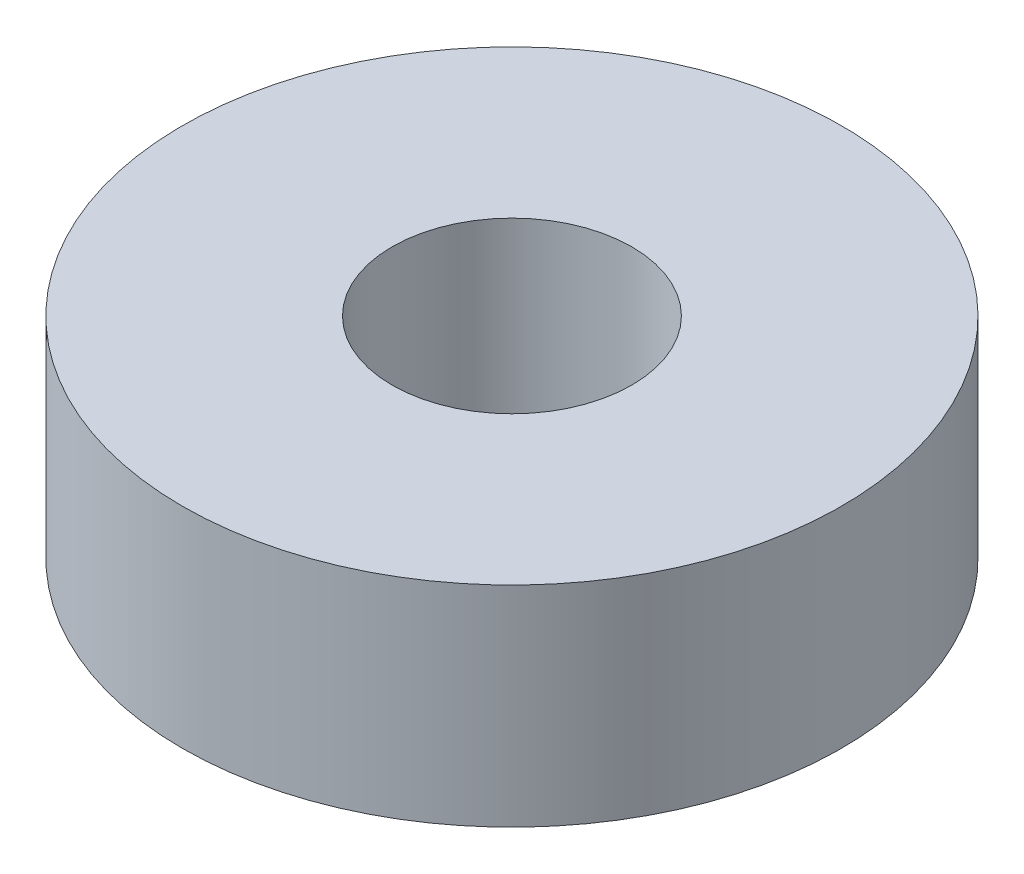
ISO-10303-21;
HEADER;
FILE_DESCRIPTION(('STEP AP214'),'2;1');
FILE_NAME('part.step','',(''),(''),'','','');
FILE_SCHEMA(('AUTOMOTIVE_DESIGN { 1 0 10303 214 1 1 1 1 }'));
ENDSEC;
DATA;
#1=APPLICATION_CONTEXT('core data for automotive mechanical design processes');
#2=APPLICATION_PROTOCOL_DEFINITION('international standard','automotive_design',2000,#1);
#3=PRODUCT_CONTEXT('',#1,'mechanical');
#4=PRODUCT('Part','Part','',(#3));
#5=PRODUCT_RELATED_PRODUCT_CATEGORY('part','',(#4));
#6=PRODUCT_DEFINITION_FORMATION('','',#4);
#7=PRODUCT_DEFINITION_CONTEXT('part definition',#1,'design');
#8=PRODUCT_DEFINITION('design','',#6,#7);
#9=PRODUCT_DEFINITION_SHAPE('','',#8);
#10=(LENGTH_UNIT() NAMED_UNIT(*) SI_UNIT(.MILLI.,.METRE.));
#11=(NAMED_UNIT(*) PLANE_ANGLE_UNIT() SI_UNIT($,.RADIAN.));
#12=(NAMED_UNIT(*) SI_UNIT($,.STERADIAN.) SOLID_ANGLE_UNIT());
#13=UNCERTAINTY_MEASURE_WITH_UNIT(LENGTH_MEASURE(1.E-05),#10,'distance_accuracy_value','');
#14=(GEOMETRIC_REPRESENTATION_CONTEXT(3) GLOBAL_UNCERTAINTY_ASSIGNED_CONTEXT((#13)) GLOBAL_UNIT_ASSIGNED_CONTEXT((#10,
#11,#12)) REPRESENTATION_CONTEXT('',''));
#15=CARTESIAN_POINT('',(0.,0.,0.));
#16=DIRECTION('',(0.,0.,1.));
#17=DIRECTION('',(1.,0.,0.));
#18=AXIS2_PLACEMENT_3D('',#15,#16,#17);
#19=CARTESIAN_POINT('',(0.,7.,0.));
#20=DIRECTION('',(0.,1.,0.));
#21=DIRECTION('',(0.,0.,1.));
#22=AXIS2_PLACEMENT_3D('',#19,#20,#21);
#23=PLANE('',#22);
#24=CARTESIAN_POINT('',(0.,7.,0.));
#25=DIRECTION('',(0.,1.,0.));
#26=DIRECTION('',(0.,0.,1.));
#27=AXIS2_PLACEMENT_3D('',#24,#25,#26);
#28=CIRCLE('',#27,11.);
#29=CARTESIAN_POINT('',(0.,7.,11.));
#30=VERTEX_POINT('',#29);
#31=EDGE_CURVE('E10',#30,#30,#28,.T.);
#32=ORIENTED_EDGE('',*,*,#31,.T.);
#33=EDGE_LOOP('',(#32));
#34=FACE_BOUND('',#33,.T.);
#35=CARTESIAN_POINT('',(0.,7.,0.));
#36=DIRECTION('',(0.,1.,0.));
#37=DIRECTION('',(0.,0.,1.));
#38=AXIS2_PLACEMENT_3D('',#35,#36,#37);
#39=CIRCLE('',#38,4.);
#40=CARTESIAN_POINT('',(0.,7.,4.));
#41=VERTEX_POINT('',#40);
#42=EDGE_CURVE('E42',#41,#41,#39,.T.);
#43=ORIENTED_EDGE('',*,*,#42,.F.);
#44=EDGE_LOOP('',(#43));
#45=FACE_BOUND('',#44,.T.);
#46=ADVANCED_FACE('F31',(#34,#45),#23,.T.);
#47=CARTESIAN_POINT('',(0.,0.,0.));
#48=DIRECTION('',(0.,1.,0.));
#49=DIRECTION('',(0.,0.,1.));
#50=AXIS2_PLACEMENT_3D('',#47,#48,#49);
#51=PLANE('',#50);
#52=CARTESIAN_POINT('',(0.,0.,0.));
#53=DIRECTION('',(0.,1.,0.));
#54=DIRECTION('',(0.,0.,1.));
#55=AXIS2_PLACEMENT_3D('',#52,#53,#54);
#56=CIRCLE('',#55,11.);
#57=CARTESIAN_POINT('',(0.,0.,11.));
#58=VERTEX_POINT('',#57);
#59=EDGE_CURVE('E35',#58,#58,#56,.T.);
#60=ORIENTED_EDGE('',*,*,#59,.F.);
#61=EDGE_LOOP('',(#60));
#62=FACE_BOUND('',#61,.T.);
#63=CARTESIAN_POINT('',(0.,0.,0.));
#64=DIRECTION('',(0.,1.,0.));
#65=DIRECTION('',(0.,0.,1.));
#66=AXIS2_PLACEMENT_3D('',#63,#64,#65);
#67=CIRCLE('',#66,4.);
#68=CARTESIAN_POINT('',(0.,0.,4.));
#69=VERTEX_POINT('',#68);
#70=EDGE_CURVE('E44',#69,#69,#67,.T.);
#71=ORIENTED_EDGE('',*,*,#70,.T.);
#72=EDGE_LOOP('',(#71));
#73=FACE_BOUND('',#72,.T.);
#74=ADVANCED_FACE('F54',(#62,#73),#51,.F.);
#75=CARTESIAN_POINT('',(0.,7.,0.));
#76=DIRECTION('',(0.,-1.,0.));
#77=DIRECTION('',(0.,0.,-1.));
#78=AXIS2_PLACEMENT_3D('',#75,#76,#77);
#79=CYLINDRICAL_SURFACE('',#78,11.);
#80=ORIENTED_EDGE('',*,*,#31,.F.);
#81=EDGE_LOOP('',(#80));
#82=FACE_BOUND('',#81,.T.);
#83=ORIENTED_EDGE('',*,*,#59,.T.);
#84=EDGE_LOOP('',(#83));
#85=FACE_BOUND('',#84,.T.);
#86=ADVANCED_FACE('F33',(#82,#85),#79,.T.);
#87=CARTESIAN_POINT('',(0.,7.,0.));
#88=DIRECTION('',(0.,-1.,0.));
#89=DIRECTION('',(0.,0.,-1.));
#90=AXIS2_PLACEMENT_3D('',#87,#88,#89);
#91=CYLINDRICAL_SURFACE('',#90,4.);
#92=ORIENTED_EDGE('',*,*,#42,.T.);
#93=EDGE_LOOP('',(#92));
#94=FACE_BOUND('',#93,.T.);
#95=ORIENTED_EDGE('',*,*,#70,.F.);
#96=EDGE_LOOP('',(#95));
#97=FACE_BOUND('',#96,.T.);
#98=ADVANCED_FACE('F50',(#94,#97),#91,.F.);
#99=CLOSED_SHELL('',(#46,#74,#86,#98));
#100=MANIFOLD_SOLID_BREP('B2',#99);
#101=ADVANCED_BREP_SHAPE_REPRESENTATION('',(#18,#100),#14);
#102=SHAPE_DEFINITION_REPRESENTATION(#9,#101);
ENDSEC;
END-ISO-10303-21;
